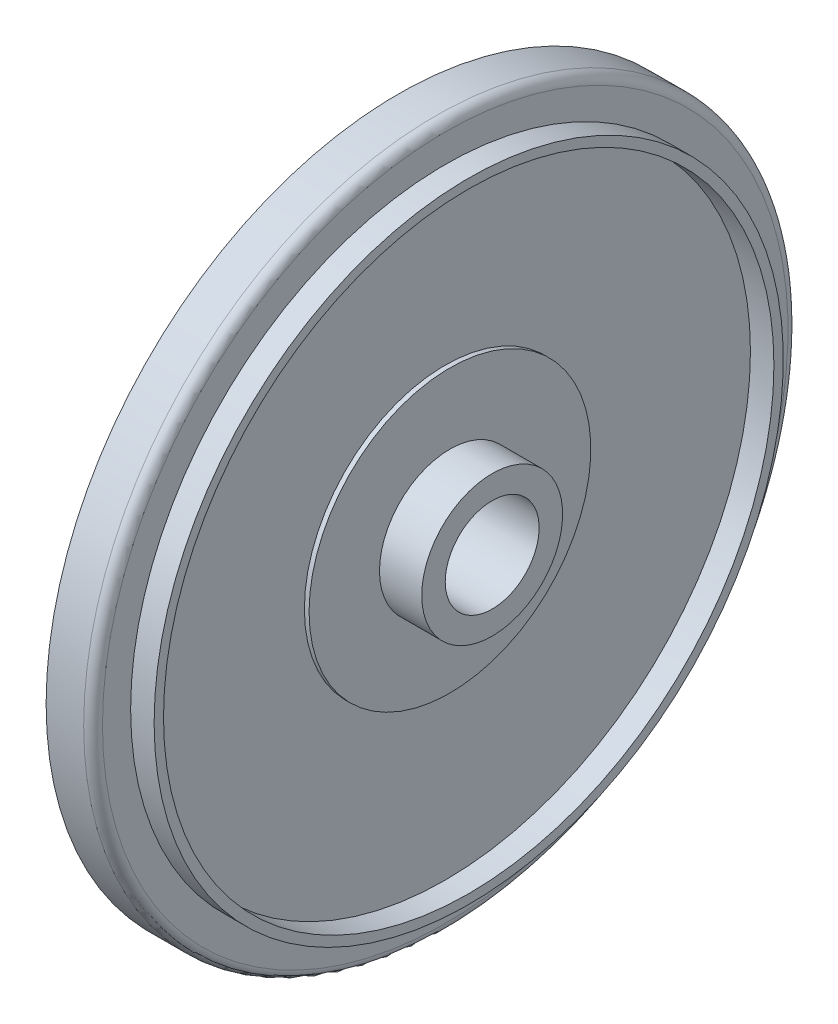
ISO-10303-21;
HEADER;
FILE_DESCRIPTION(('STEP AP214'),'2;1');
FILE_NAME('part.step','',(''),(''),'','','');
FILE_SCHEMA(('AUTOMOTIVE_DESIGN { 1 0 10303 214 1 1 1 1 }'));
ENDSEC;
DATA;
#1=APPLICATION_CONTEXT('core data for automotive mechanical design processes');
#2=APPLICATION_PROTOCOL_DEFINITION('international standard','automotive_design',2000,#1);
#3=PRODUCT_CONTEXT('',#1,'mechanical');
#4=PRODUCT('Part','Part','',(#3));
#5=PRODUCT_RELATED_PRODUCT_CATEGORY('part','',(#4));
#6=PRODUCT_DEFINITION_FORMATION('','',#4);
#7=PRODUCT_DEFINITION_CONTEXT('part definition',#1,'design');
#8=PRODUCT_DEFINITION('design','',#6,#7);
#9=PRODUCT_DEFINITION_SHAPE('','',#8);
#10=(LENGTH_UNIT() NAMED_UNIT(*) SI_UNIT(.MILLI.,.METRE.));
#11=(NAMED_UNIT(*) PLANE_ANGLE_UNIT() SI_UNIT($,.RADIAN.));
#12=(NAMED_UNIT(*) SI_UNIT($,.STERADIAN.) SOLID_ANGLE_UNIT());
#13=UNCERTAINTY_MEASURE_WITH_UNIT(LENGTH_MEASURE(1.E-05),#10,'distance_accuracy_value','');
#14=(GEOMETRIC_REPRESENTATION_CONTEXT(3) GLOBAL_UNCERTAINTY_ASSIGNED_CONTEXT((#13)) GLOBAL_UNIT_ASSIGNED_CONTEXT((#10,
#11,#12)) REPRESENTATION_CONTEXT('',''));
#15=CARTESIAN_POINT('',(0.,0.,0.));
#16=DIRECTION('',(0.,0.,1.));
#17=DIRECTION('',(1.,0.,0.));
#18=AXIS2_PLACEMENT_3D('',#15,#16,#17);
#19=CARTESIAN_POINT('',(0.,0.,0.));
#20=DIRECTION('',(-1.,0.,0.));
#21=DIRECTION('',(0.,0.,1.));
#22=AXIS2_PLACEMENT_3D('',#19,#20,#21);
#23=CYLINDRICAL_SURFACE('',#22,7.5);
#24=CARTESIAN_POINT('',(3.8,0.,0.));
#25=DIRECTION('',(-1.,0.,0.));
#26=DIRECTION('',(0.,0.,1.));
#27=AXIS2_PLACEMENT_3D('',#24,#25,#26);
#28=CIRCLE('',#27,7.5);
#29=CARTESIAN_POINT('',(3.8,0.,7.5));
#30=VERTEX_POINT('',#29);
#31=EDGE_CURVE('E45',#30,#30,#28,.T.);
#32=ORIENTED_EDGE('',*,*,#31,.T.);
#33=EDGE_LOOP('',(#32));
#34=FACE_BOUND('',#33,.T.);
#35=CARTESIAN_POINT('',(3.,0.,0.));
#36=DIRECTION('',(-1.,0.,0.));
#37=DIRECTION('',(0.,0.,1.));
#38=AXIS2_PLACEMENT_3D('',#35,#36,#37);
#39=CIRCLE('',#38,7.5);
#40=CARTESIAN_POINT('',(3.,0.,7.5));
#41=VERTEX_POINT('',#40);
#42=EDGE_CURVE('E93',#41,#41,#39,.T.);
#43=ORIENTED_EDGE('',*,*,#42,.F.);
#44=EDGE_LOOP('',(#43));
#45=FACE_BOUND('',#44,.T.);
#46=ADVANCED_FACE('F37',(#34,#45),#23,.T.);
#47=CARTESIAN_POINT('',(4.,7.5,0.));
#48=DIRECTION('',(-1.,0.,0.));
#49=DIRECTION('',(0.,0.,1.));
#50=AXIS2_PLACEMENT_3D('',#47,#48,#49);
#51=PLANE('',#50);
#52=CARTESIAN_POINT('',(4.,0.,0.));
#53=DIRECTION('',(-1.,0.,0.));
#54=DIRECTION('',(0.,0.,1.));
#55=AXIS2_PLACEMENT_3D('',#52,#53,#54);
#56=CIRCLE('',#55,7.3);
#57=CARTESIAN_POINT('',(4.,0.,7.3));
#58=VERTEX_POINT('',#57);
#59=EDGE_CURVE('E10',#58,#58,#56,.F.);
#60=ORIENTED_EDGE('',*,*,#59,.T.);
#61=EDGE_LOOP('',(#60));
#62=FACE_BOUND('',#61,.T.);
#63=CARTESIAN_POINT('',(4.,0.,0.));
#64=DIRECTION('',(-1.,0.,0.));
#65=DIRECTION('',(0.,0.,1.));
#66=AXIS2_PLACEMENT_3D('',#63,#64,#65);
#67=CIRCLE('',#66,6.7);
#68=CARTESIAN_POINT('',(4.,0.,6.7));
#69=VERTEX_POINT('',#68);
#70=EDGE_CURVE('E50',#69,#69,#67,.T.);
#71=ORIENTED_EDGE('',*,*,#70,.T.);
#72=EDGE_LOOP('',(#71));
#73=FACE_BOUND('',#72,.T.);
#74=ADVANCED_FACE('F101',(#62,#73),#51,.F.);
#75=CARTESIAN_POINT('',(0.,0.,0.));
#76=DIRECTION('',(-1.,0.,0.));
#77=DIRECTION('',(0.,0.,1.));
#78=AXIS2_PLACEMENT_3D('',#75,#76,#77);
#79=CYLINDRICAL_SURFACE('',#78,6.7);
#80=ORIENTED_EDGE('',*,*,#70,.F.);
#81=EDGE_LOOP('',(#80));
#82=FACE_BOUND('',#81,.T.);
#83=CARTESIAN_POINT('',(4.5,0.,0.));
#84=DIRECTION('',(-1.,0.,0.));
#85=DIRECTION('',(0.,0.,1.));
#86=AXIS2_PLACEMENT_3D('',#83,#84,#85);
#87=CIRCLE('',#86,6.7);
#88=CARTESIAN_POINT('',(4.5,0.,6.7));
#89=VERTEX_POINT('',#88);
#90=EDGE_CURVE('E55',#89,#89,#87,.T.);
#91=ORIENTED_EDGE('',*,*,#90,.T.);
#92=EDGE_LOOP('',(#91));
#93=FACE_BOUND('',#92,.T.);
#94=ADVANCED_FACE('F105',(#82,#93),#79,.T.);
#95=CARTESIAN_POINT('',(4.5,6.7,0.));
#96=DIRECTION('',(-1.,0.,0.));
#97=DIRECTION('',(0.,0.,1.));
#98=AXIS2_PLACEMENT_3D('',#95,#96,#97);
#99=PLANE('',#98);
#100=ORIENTED_EDGE('',*,*,#90,.F.);
#101=EDGE_LOOP('',(#100));
#102=FACE_BOUND('',#101,.T.);
#103=CARTESIAN_POINT('',(4.5,0.,0.));
#104=DIRECTION('',(-1.,0.,0.));
#105=DIRECTION('',(0.,0.,1.));
#106=AXIS2_PLACEMENT_3D('',#103,#104,#105);
#107=CIRCLE('',#106,6.5);
#108=CARTESIAN_POINT('',(4.5,0.,6.5));
#109=VERTEX_POINT('',#108);
#110=EDGE_CURVE('E61',#109,#109,#107,.T.);
#111=ORIENTED_EDGE('',*,*,#110,.T.);
#112=EDGE_LOOP('',(#111));
#113=FACE_BOUND('',#112,.T.);
#114=ADVANCED_FACE('F110',(#102,#113),#99,.F.);
#115=CARTESIAN_POINT('',(0.,0.,0.));
#116=DIRECTION('',(-1.,0.,0.));
#117=DIRECTION('',(0.,0.,1.));
#118=AXIS2_PLACEMENT_3D('',#115,#116,#117);
#119=CYLINDRICAL_SURFACE('',#118,6.5);
#120=ORIENTED_EDGE('',*,*,#110,.F.);
#121=EDGE_LOOP('',(#120));
#122=FACE_BOUND('',#121,.T.);
#123=CARTESIAN_POINT('',(4.,0.,0.));
#124=DIRECTION('',(-1.,0.,0.));
#125=DIRECTION('',(0.,0.,1.));
#126=AXIS2_PLACEMENT_3D('',#123,#124,#125);
#127=CIRCLE('',#126,6.5);
#128=CARTESIAN_POINT('',(4.,0.,6.5));
#129=VERTEX_POINT('',#128);
#130=EDGE_CURVE('E65',#129,#129,#127,.T.);
#131=ORIENTED_EDGE('',*,*,#130,.T.);
#132=EDGE_LOOP('',(#131));
#133=FACE_BOUND('',#132,.T.);
#134=ADVANCED_FACE('F114',(#122,#133),#119,.F.);
#135=CARTESIAN_POINT('',(4.,6.5,0.));
#136=DIRECTION('',(-1.,0.,0.));
#137=DIRECTION('',(0.,0.,1.));
#138=AXIS2_PLACEMENT_3D('',#135,#136,#137);
#139=PLANE('',#138);
#140=ORIENTED_EDGE('',*,*,#130,.F.);
#141=EDGE_LOOP('',(#140));
#142=FACE_BOUND('',#141,.T.);
#143=CARTESIAN_POINT('',(4.,0.,0.));
#144=DIRECTION('',(-1.,0.,0.));
#145=DIRECTION('',(0.,0.,1.));
#146=AXIS2_PLACEMENT_3D('',#143,#144,#145);
#147=CIRCLE('',#146,3.);
#148=CARTESIAN_POINT('',(4.,0.,3.));
#149=VERTEX_POINT('',#148);
#150=EDGE_CURVE('E69',#149,#149,#147,.T.);
#151=ORIENTED_EDGE('',*,*,#150,.T.);
#152=EDGE_LOOP('',(#151));
#153=FACE_BOUND('',#152,.T.);
#154=ADVANCED_FACE('F118',(#142,#153),#139,.F.);
#155=CARTESIAN_POINT('',(0.,0.,0.));
#156=DIRECTION('',(-1.,0.,0.));
#157=DIRECTION('',(0.,0.,1.));
#158=AXIS2_PLACEMENT_3D('',#155,#156,#157);
#159=CYLINDRICAL_SURFACE('',#158,3.);
#160=ORIENTED_EDGE('',*,*,#150,.F.);
#161=EDGE_LOOP('',(#160));
#162=FACE_BOUND('',#161,.T.);
#163=CARTESIAN_POINT('',(4.1,0.,0.));
#164=DIRECTION('',(-1.,0.,0.));
#165=DIRECTION('',(0.,0.,1.));
#166=AXIS2_PLACEMENT_3D('',#163,#164,#165);
#167=CIRCLE('',#166,3.);
#168=CARTESIAN_POINT('',(4.1,0.,3.));
#169=VERTEX_POINT('',#168);
#170=EDGE_CURVE('E73',#169,#169,#167,.T.);
#171=ORIENTED_EDGE('',*,*,#170,.T.);
#172=EDGE_LOOP('',(#171));
#173=FACE_BOUND('',#172,.T.);
#174=ADVANCED_FACE('F122',(#162,#173),#159,.T.);
#175=CARTESIAN_POINT('',(4.1,3.,0.));
#176=DIRECTION('',(-1.,0.,0.));
#177=DIRECTION('',(0.,0.,1.));
#178=AXIS2_PLACEMENT_3D('',#175,#176,#177);
#179=PLANE('',#178);
#180=ORIENTED_EDGE('',*,*,#170,.F.);
#181=EDGE_LOOP('',(#180));
#182=FACE_BOUND('',#181,.T.);
#183=CARTESIAN_POINT('',(4.1,0.,0.));
#184=DIRECTION('',(-1.,0.,0.));
#185=DIRECTION('',(0.,0.,1.));
#186=AXIS2_PLACEMENT_3D('',#183,#184,#185);
#187=CIRCLE('',#186,1.5);
#188=CARTESIAN_POINT('',(4.1,0.,1.5));
#189=VERTEX_POINT('',#188);
#190=EDGE_CURVE('E77',#189,#189,#187,.T.);
#191=ORIENTED_EDGE('',*,*,#190,.T.);
#192=EDGE_LOOP('',(#191));
#193=FACE_BOUND('',#192,.T.);
#194=ADVANCED_FACE('F126',(#182,#193),#179,.F.);
#195=CARTESIAN_POINT('',(0.,0.,0.));
#196=DIRECTION('',(-1.,0.,0.));
#197=DIRECTION('',(0.,0.,1.));
#198=AXIS2_PLACEMENT_3D('',#195,#196,#197);
#199=CYLINDRICAL_SURFACE('',#198,1.5);
#200=ORIENTED_EDGE('',*,*,#190,.F.);
#201=EDGE_LOOP('',(#200));
#202=FACE_BOUND('',#201,.T.);
#203=CARTESIAN_POINT('',(5.,0.,0.));
#204=DIRECTION('',(-1.,0.,0.));
#205=DIRECTION('',(0.,0.,1.));
#206=AXIS2_PLACEMENT_3D('',#203,#204,#205);
#207=CIRCLE('',#206,1.5);
#208=CARTESIAN_POINT('',(5.,0.,1.5));
#209=VERTEX_POINT('',#208);
#210=EDGE_CURVE('E81',#209,#209,#207,.T.);
#211=ORIENTED_EDGE('',*,*,#210,.T.);
#212=EDGE_LOOP('',(#211));
#213=FACE_BOUND('',#212,.T.);
#214=ADVANCED_FACE('F130',(#202,#213),#199,.T.);
#215=CARTESIAN_POINT('',(5.,1.5,0.));
#216=DIRECTION('',(-1.,0.,0.));
#217=DIRECTION('',(0.,0.,1.));
#218=AXIS2_PLACEMENT_3D('',#215,#216,#217);
#219=PLANE('',#218);
#220=ORIENTED_EDGE('',*,*,#210,.F.);
#221=EDGE_LOOP('',(#220));
#222=FACE_BOUND('',#221,.T.);
#223=CARTESIAN_POINT('',(5.,0.,0.));
#224=DIRECTION('',(-1.,0.,0.));
#225=DIRECTION('',(0.,0.,1.));
#226=AXIS2_PLACEMENT_3D('',#223,#224,#225);
#227=CIRCLE('',#226,1.);
#228=CARTESIAN_POINT('',(5.,0.,1.));
#229=VERTEX_POINT('',#228);
#230=EDGE_CURVE('E85',#229,#229,#227,.T.);
#231=ORIENTED_EDGE('',*,*,#230,.T.);
#232=EDGE_LOOP('',(#231));
#233=FACE_BOUND('',#232,.T.);
#234=ADVANCED_FACE('F134',(#222,#233),#219,.F.);
#235=CARTESIAN_POINT('',(0.,0.,0.));
#236=DIRECTION('',(-1.,0.,0.));
#237=DIRECTION('',(0.,0.,1.));
#238=AXIS2_PLACEMENT_3D('',#235,#236,#237);
#239=CYLINDRICAL_SURFACE('',#238,1.);
#240=ORIENTED_EDGE('',*,*,#230,.F.);
#241=EDGE_LOOP('',(#240));
#242=FACE_BOUND('',#241,.T.);
#243=CARTESIAN_POINT('',(3.,0.,0.));
#244=DIRECTION('',(-1.,0.,0.));
#245=DIRECTION('',(0.,0.,1.));
#246=AXIS2_PLACEMENT_3D('',#243,#244,#245);
#247=CIRCLE('',#246,1.);
#248=CARTESIAN_POINT('',(3.,0.,1.));
#249=VERTEX_POINT('',#248);
#250=EDGE_CURVE('E89',#249,#249,#247,.T.);
#251=ORIENTED_EDGE('',*,*,#250,.T.);
#252=EDGE_LOOP('',(#251));
#253=FACE_BOUND('',#252,.T.);
#254=ADVANCED_FACE('F138',(#242,#253),#239,.F.);
#255=CARTESIAN_POINT('',(3.,1.,0.));
#256=DIRECTION('',(1.,0.,0.));
#257=DIRECTION('',(0.,0.,-1.));
#258=AXIS2_PLACEMENT_3D('',#255,#256,#257);
#259=PLANE('',#258);
#260=ORIENTED_EDGE('',*,*,#250,.F.);
#261=EDGE_LOOP('',(#260));
#262=FACE_BOUND('',#261,.T.);
#263=ORIENTED_EDGE('',*,*,#42,.T.);
#264=EDGE_LOOP('',(#263));
#265=FACE_BOUND('',#264,.T.);
#266=ADVANCED_FACE('F98',(#262,#265),#259,.F.);
#267=CARTESIAN_POINT('',(3.8,0.,0.));
#268=DIRECTION('',(-1.,0.,0.));
#269=DIRECTION('',(0.,0.,1.));
#270=AXIS2_PLACEMENT_3D('',#267,#268,#269);
#271=TOROIDAL_SURFACE('',#270,7.3,0.2);
#272=ORIENTED_EDGE('',*,*,#59,.F.);
#273=EDGE_LOOP('',(#272));
#274=FACE_BOUND('',#273,.T.);
#275=ORIENTED_EDGE('',*,*,#31,.F.);
#276=EDGE_LOOP('',(#275));
#277=FACE_BOUND('',#276,.T.);
#278=ADVANCED_FACE('F39',(#274,#277),#271,.T.);
#279=CLOSED_SHELL('',(#46,#74,#94,#114,#134,#154,#174,#194,#214,#234,#254,#266,#278));
#280=MANIFOLD_SOLID_BREP('B2',#279);
#281=ADVANCED_BREP_SHAPE_REPRESENTATION('',(#18,#280),#14);
#282=SHAPE_DEFINITION_REPRESENTATION(#9,#281);
ENDSEC;
END-ISO-10303-21;
